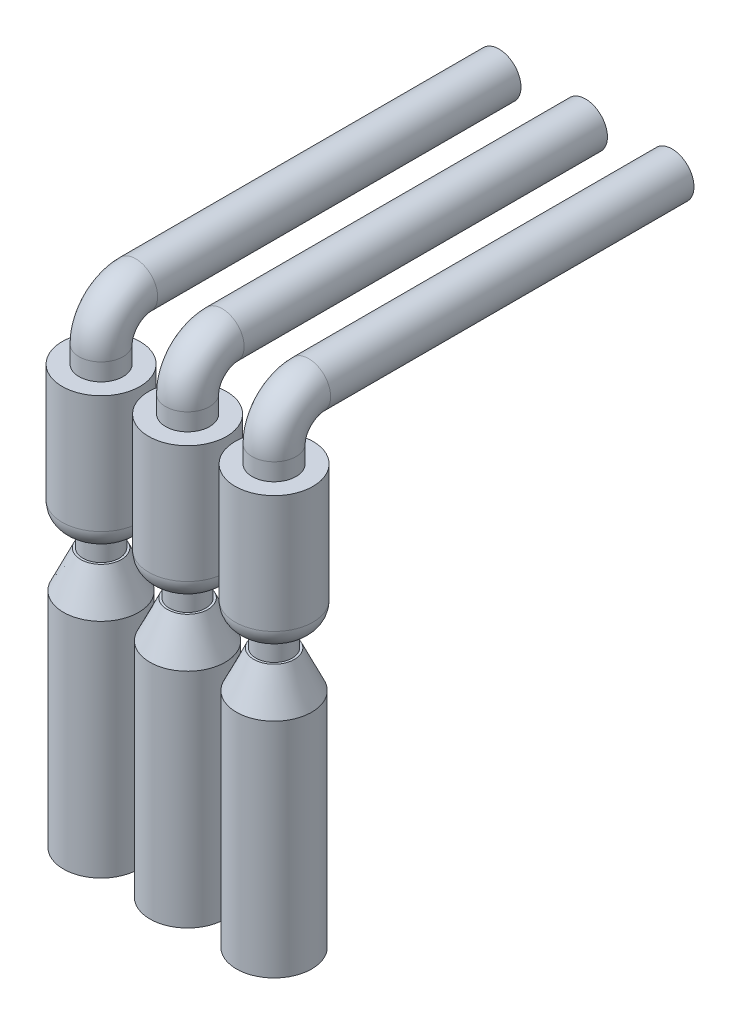
ISO-10303-21;
HEADER;
FILE_DESCRIPTION(('STEP AP214'),'2;1');
FILE_NAME('part.step','',(''),(''),'','','');
FILE_SCHEMA(('AUTOMOTIVE_DESIGN { 1 0 10303 214 1 1 1 1 }'));
ENDSEC;
DATA;
#1=APPLICATION_CONTEXT('core data for automotive mechanical design processes');
#2=APPLICATION_PROTOCOL_DEFINITION('international standard','automotive_design',2000,#1);
#3=PRODUCT_CONTEXT('',#1,'mechanical');
#4=PRODUCT('Part','Part','',(#3));
#5=PRODUCT_RELATED_PRODUCT_CATEGORY('part','',(#4));
#6=PRODUCT_DEFINITION_FORMATION('','',#4);
#7=PRODUCT_DEFINITION_CONTEXT('part definition',#1,'design');
#8=PRODUCT_DEFINITION('design','',#6,#7);
#9=PRODUCT_DEFINITION_SHAPE('','',#8);
#10=(LENGTH_UNIT() NAMED_UNIT(*) SI_UNIT(.MILLI.,.METRE.));
#11=(NAMED_UNIT(*) PLANE_ANGLE_UNIT() SI_UNIT($,.RADIAN.));
#12=(NAMED_UNIT(*) SI_UNIT($,.STERADIAN.) SOLID_ANGLE_UNIT());
#13=UNCERTAINTY_MEASURE_WITH_UNIT(LENGTH_MEASURE(1.E-05),#10,'distance_accuracy_value','');
#14=(GEOMETRIC_REPRESENTATION_CONTEXT(3) GLOBAL_UNCERTAINTY_ASSIGNED_CONTEXT((#13)) GLOBAL_UNIT_ASSIGNED_CONTEXT((#10,
#11,#12)) REPRESENTATION_CONTEXT('',''));
#15=CARTESIAN_POINT('',(0.,0.,0.));
#16=DIRECTION('',(0.,0.,1.));
#17=DIRECTION('',(1.,0.,0.));
#18=AXIS2_PLACEMENT_3D('',#15,#16,#17);
#19=CARTESIAN_POINT('',(1000.,0.,2000.));
#20=DIRECTION('',(0.,0.,-1.));
#21=DIRECTION('',(-1.,0.,0.));
#22=AXIS2_PLACEMENT_3D('',#19,#20,#21);
#23=CYLINDRICAL_SURFACE('',#22,127.);
#24=CARTESIAN_POINT('',(1000.,0.,0.));
#25=DIRECTION('',(0.,0.,1.));
#26=DIRECTION('',(1.,0.,0.));
#27=AXIS2_PLACEMENT_3D('',#24,#25,#26);
#28=CIRCLE('',#27,127.);
#29=CARTESIAN_POINT('',(1127.,0.,0.));
#30=VERTEX_POINT('',#29);
#31=EDGE_CURVE('E60',#30,#30,#28,.T.);
#32=ORIENTED_EDGE('',*,*,#31,.T.);
#33=EDGE_LOOP('',(#32));
#34=FACE_BOUND('',#33,.T.);
#35=CARTESIAN_POINT('',(1000.,0.,2100.));
#36=DIRECTION('',(0.,0.,1.));
#37=DIRECTION('',(1.,0.,0.));
#38=AXIS2_PLACEMENT_3D('',#35,#36,#37);
#39=CIRCLE('',#38,127.);
#40=CARTESIAN_POINT('',(1000.,127.,2100.));
#41=VERTEX_POINT('',#40);
#42=EDGE_CURVE('E69',#41,#41,#39,.T.);
#43=ORIENTED_EDGE('',*,*,#42,.F.);
#44=EDGE_LOOP('',(#43));
#45=FACE_BOUND('',#44,.T.);
#46=ADVANCED_FACE('F40',(#34,#45),#23,.T.);
#47=CARTESIAN_POINT('',(1000.,0.,0.));
#48=DIRECTION('',(0.,0.,1.));
#49=DIRECTION('',(1.,0.,0.));
#50=AXIS2_PLACEMENT_3D('',#47,#48,#49);
#51=PLANE('',#50);
#52=ORIENTED_EDGE('',*,*,#31,.F.);
#53=EDGE_LOOP('',(#52));
#54=FACE_BOUND('',#53,.T.);
#55=ADVANCED_FACE('F99',(#54),#51,.F.);
#56=CARTESIAN_POINT('',(1000.,-200.,2100.));
#57=DIRECTION('',(1.,0.,0.));
#58=DIRECTION('',(0.,0.,-1.));
#59=AXIS2_PLACEMENT_3D('',#56,#57,#58);
#60=TOROIDAL_SURFACE('',#59,200.,127.);
#61=CARTESIAN_POINT('',(1000.,-200.,2300.));
#62=DIRECTION('',(0.,-1.,0.));
#63=DIRECTION('',(1.,0.,0.));
#64=AXIS2_PLACEMENT_3D('',#61,#62,#63);
#65=CIRCLE('',#64,127.);
#66=CARTESIAN_POINT('',(1000.,-200.,2427.));
#67=VERTEX_POINT('',#66);
#68=EDGE_CURVE('E66',#67,#67,#65,.T.);
#69=CARTESIAN_POINT('',(1000.,-200.,2100.));
#70=DIRECTION('',(1.,0.,0.));
#71=DIRECTION('',(0.,0.,-1.));
#72=AXIS2_PLACEMENT_3D('',#69,#70,#71);
#73=CIRCLE('',#72,327.);
#74=EDGE_CURVE('',#41,#67,#73,.T.);
#75=ORIENTED_EDGE('',*,*,#42,.T.);
#76=ORIENTED_EDGE('',*,*,#68,.F.);
#77=ORIENTED_EDGE('',*,*,#74,.T.);
#78=ORIENTED_EDGE('',*,*,#74,.F.);
#79=EDGE_LOOP('',(#75,#77,#76,#78));
#80=FACE_BOUND('',#79,.T.);
#81=ADVANCED_FACE('F105',(#80),#60,.T.);
#82=CARTESIAN_POINT('',(1000.,-200.,2300.));
#83=DIRECTION('',(0.,-1.,0.));
#84=DIRECTION('',(0.,0.,-1.));
#85=AXIS2_PLACEMENT_3D('',#82,#83,#84);
#86=CYLINDRICAL_SURFACE('',#85,127.);
#87=CARTESIAN_POINT('',(1000.,-300.,2300.));
#88=DIRECTION('',(0.,-1.,0.));
#89=DIRECTION('',(1.,0.,0.));
#90=AXIS2_PLACEMENT_3D('',#87,#88,#89);
#91=CIRCLE('',#90,127.);
#92=CARTESIAN_POINT('',(1127.,-300.,2300.));
#93=VERTEX_POINT('',#92);
#94=EDGE_CURVE('E63',#93,#93,#91,.T.);
#95=ORIENTED_EDGE('',*,*,#94,.F.);
#96=EDGE_LOOP('',(#95));
#97=FACE_BOUND('',#96,.T.);
#98=ORIENTED_EDGE('',*,*,#68,.T.);
#99=EDGE_LOOP('',(#98));
#100=FACE_BOUND('',#99,.T.);
#101=ADVANCED_FACE('F108',(#97,#100),#86,.T.);
#102=CARTESIAN_POINT('',(1000.,-1100.,2300.));
#103=DIRECTION('',(0.,1.,0.));
#104=DIRECTION('',(-1.,0.,0.));
#105=AXIS2_PLACEMENT_3D('',#102,#103,#104);
#106=CYLINDRICAL_SURFACE('',#105,225.);
#107=CARTESIAN_POINT('',(1000.,-980.,2300.));
#108=DIRECTION('',(0.,-1.,0.));
#109=DIRECTION('',(1.,0.,0.));
#110=AXIS2_PLACEMENT_3D('',#107,#108,#109);
#111=CIRCLE('',#110,225.);
#112=CARTESIAN_POINT('',(1225.,-980.,2300.));
#113=VERTEX_POINT('',#112);
#114=EDGE_CURVE('E51',#113,#113,#111,.F.);
#115=ORIENTED_EDGE('',*,*,#114,.T.);
#116=EDGE_LOOP('',(#115));
#117=FACE_BOUND('',#116,.T.);
#118=CARTESIAN_POINT('',(1000.,-300.,2300.));
#119=DIRECTION('',(0.,-1.,0.));
#120=DIRECTION('',(1.,0.,0.));
#121=AXIS2_PLACEMENT_3D('',#118,#119,#120);
#122=CIRCLE('',#121,225.);
#123=CARTESIAN_POINT('',(1225.,-300.,2300.));
#124=VERTEX_POINT('',#123);
#125=EDGE_CURVE('E72',#124,#124,#122,.T.);
#126=ORIENTED_EDGE('',*,*,#125,.T.);
#127=EDGE_LOOP('',(#126));
#128=FACE_BOUND('',#127,.T.);
#129=ADVANCED_FACE('F117',(#117,#128),#106,.T.);
#130=CARTESIAN_POINT('',(1000.,-300.,2300.));
#131=DIRECTION('',(0.,-1.,0.));
#132=DIRECTION('',(1.,0.,0.));
#133=AXIS2_PLACEMENT_3D('',#130,#131,#132);
#134=PLANE('',#133);
#135=ORIENTED_EDGE('',*,*,#94,.T.);
#136=EDGE_LOOP('',(#135));
#137=FACE_BOUND('',#136,.T.);
#138=ORIENTED_EDGE('',*,*,#125,.F.);
#139=EDGE_LOOP('',(#138));
#140=FACE_BOUND('',#139,.T.);
#141=ADVANCED_FACE('F112',(#137,#140),#134,.F.);
#142=CARTESIAN_POINT('',(1000.,-980.,2300.));
#143=DIRECTION('',(0.,-1.,0.));
#144=DIRECTION('',(1.,0.,0.));
#145=AXIS2_PLACEMENT_3D('',#142,#143,#144);
#146=DEGENERATE_TOROIDAL_SURFACE('',#145,105.,120.,.T.);
#147=ORIENTED_EDGE('',*,*,#114,.F.);
#148=EDGE_LOOP('',(#147));
#149=FACE_BOUND('',#148,.T.);
#150=CARTESIAN_POINT('',(1000.,-1100.,2300.));
#151=DIRECTION('',(0.,-1.,0.));
#152=DIRECTION('',(1.,0.,0.));
#153=AXIS2_PLACEMENT_3D('',#150,#151,#152);
#154=CIRCLE('',#153,105.);
#155=CARTESIAN_POINT('',(1105.,-1100.,2300.));
#156=VERTEX_POINT('',#155);
#157=EDGE_CURVE('E55',#156,#156,#154,.T.);
#158=ORIENTED_EDGE('',*,*,#157,.F.);
#159=EDGE_LOOP('',(#158));
#160=FACE_BOUND('',#159,.T.);
#161=ADVANCED_FACE('F94',(#149,#160),#146,.T.);
#162=CARTESIAN_POINT('',(1000.,-1220.,2300.));
#163=DIRECTION('',(0.,1.,0.));
#164=DIRECTION('',(-1.,0.,0.));
#165=AXIS2_PLACEMENT_3D('',#162,#163,#164);
#166=CYLINDRICAL_SURFACE('',#165,105.);
#167=CARTESIAN_POINT('',(1000.,-1220.,2300.));
#168=DIRECTION('',(0.,-1.,0.));
#169=DIRECTION('',(1.,0.,0.));
#170=AXIS2_PLACEMENT_3D('',#167,#168,#169);
#171=CIRCLE('',#170,105.);
#172=CARTESIAN_POINT('',(1105.,-1220.,2300.));
#173=VERTEX_POINT('',#172);
#174=EDGE_CURVE('E75',#173,#173,#171,.T.);
#175=ORIENTED_EDGE('',*,*,#174,.F.);
#176=EDGE_LOOP('',(#175));
#177=FACE_BOUND('',#176,.T.);
#178=ORIENTED_EDGE('',*,*,#157,.T.);
#179=EDGE_LOOP('',(#178));
#180=FACE_BOUND('',#179,.T.);
#181=ADVANCED_FACE('F86',(#177,#180),#166,.T.);
#182=CARTESIAN_POINT('',(1000.,-2720.,2300.));
#183=DIRECTION('',(0.,1.,0.));
#184=DIRECTION('',(-1.,0.,0.));
#185=AXIS2_PLACEMENT_3D('',#182,#183,#184);
#186=CYLINDRICAL_SURFACE('',#185,217.5);
#187=CARTESIAN_POINT('',(1000.,-1434.45069205095,2300.));
#188=DIRECTION('',(0.,-1.,0.));
#189=DIRECTION('',(0.,0.,-1.));
#190=AXIS2_PLACEMENT_3D('',#187,#188,#189);
#191=CIRCLE('',#190,217.5);
#192=CARTESIAN_POINT('',(1000.,-1434.45069205095,2082.5));
#193=VERTEX_POINT('',#192);
#194=EDGE_CURVE('E47',#193,#193,#191,.T.);
#195=ORIENTED_EDGE('',*,*,#194,.T.);
#196=EDGE_LOOP('',(#195));
#197=FACE_BOUND('',#196,.T.);
#198=CARTESIAN_POINT('',(1000.,-2720.,2300.));
#199=DIRECTION('',(0.,-1.,0.));
#200=DIRECTION('',(1.,0.,0.));
#201=AXIS2_PLACEMENT_3D('',#198,#199,#200);
#202=CIRCLE('',#201,217.5);
#203=CARTESIAN_POINT('',(1217.5,-2720.,2300.));
#204=VERTEX_POINT('',#203);
#205=EDGE_CURVE('E78',#204,#204,#202,.T.);
#206=ORIENTED_EDGE('',*,*,#205,.F.);
#207=EDGE_LOOP('',(#206));
#208=FACE_BOUND('',#207,.T.);
#209=ADVANCED_FACE('F84',(#197,#208),#186,.T.);
#210=CARTESIAN_POINT('',(1000.,-2720.,2300.));
#211=DIRECTION('',(0.,-1.,0.));
#212=DIRECTION('',(1.,0.,0.));
#213=AXIS2_PLACEMENT_3D('',#210,#211,#212);
#214=PLANE('',#213);
#215=ORIENTED_EDGE('',*,*,#205,.T.);
#216=EDGE_LOOP('',(#215));
#217=FACE_BOUND('',#216,.T.);
#218=ADVANCED_FACE('F82',(#217),#214,.T.);
#219=CARTESIAN_POINT('',(1000.,-1220.,2300.));
#220=DIRECTION('',(0.,-1.,0.));
#221=DIRECTION('',(1.,0.,0.));
#222=AXIS2_PLACEMENT_3D('',#219,#220,#221);
#223=PLANE('',#222);
#224=CARTESIAN_POINT('',(1000.,-1220.,2300.));
#225=DIRECTION('',(0.,-1.,0.));
#226=DIRECTION('',(1.,0.,0.));
#227=AXIS2_PLACEMENT_3D('',#224,#225,#226);
#228=CIRCLE('',#227,117.500000000001);
#229=CARTESIAN_POINT('',(1117.5,-1220.,2300.));
#230=VERTEX_POINT('',#229);
#231=EDGE_CURVE('E11',#230,#230,#228,.F.);
#232=ORIENTED_EDGE('',*,*,#231,.T.);
#233=EDGE_LOOP('',(#232));
#234=FACE_BOUND('',#233,.T.);
#235=ORIENTED_EDGE('',*,*,#174,.T.);
#236=EDGE_LOOP('',(#235));
#237=FACE_BOUND('',#236,.T.);
#238=ADVANCED_FACE('F92',(#234,#237),#223,.F.);
#239=CARTESIAN_POINT('',(1000.,-1434.45069205095,2300.));
#240=DIRECTION('',(0.,-1.,0.));
#241=DIRECTION('',(0.,0.,-1.));
#242=AXIS2_PLACEMENT_3D('',#239,#240,#241);
#243=CONICAL_SURFACE('',#242,217.5,0.436332312998585);
#244=ORIENTED_EDGE('',*,*,#231,.F.);
#245=EDGE_LOOP('',(#244));
#246=FACE_BOUND('',#245,.T.);
#247=ORIENTED_EDGE('',*,*,#194,.F.);
#248=EDGE_LOOP('',(#247));
#249=FACE_BOUND('',#248,.T.);
#250=ADVANCED_FACE('F42',(#246,#249),#243,.T.);
#251=CLOSED_SHELL('',(#46,#55,#81,#101,#129,#141,#161,#181,#209,#218,#238,#250));
#252=MANIFOLD_SOLID_BREP('B2',#251);
#253=CARTESIAN_POINT('',(500.,0.,2000.));
#254=DIRECTION('',(0.,0.,-1.));
#255=DIRECTION('',(-1.,0.,0.));
#256=AXIS2_PLACEMENT_3D('',#253,#254,#255);
#257=CYLINDRICAL_SURFACE('',#256,127.);
#258=CARTESIAN_POINT('',(500.,0.,0.));
#259=DIRECTION('',(0.,0.,1.));
#260=DIRECTION('',(1.,0.,0.));
#261=AXIS2_PLACEMENT_3D('',#258,#259,#260);
#262=CIRCLE('',#261,127.);
#263=CARTESIAN_POINT('',(627.,0.,0.));
#264=VERTEX_POINT('',#263);
#265=EDGE_CURVE('E246',#264,#264,#262,.T.);
#266=ORIENTED_EDGE('',*,*,#265,.T.);
#267=EDGE_LOOP('',(#266));
#268=FACE_BOUND('',#267,.T.);
#269=CARTESIAN_POINT('',(500.,0.,2100.));
#270=DIRECTION('',(0.,0.,1.));
#271=DIRECTION('',(1.,0.,0.));
#272=AXIS2_PLACEMENT_3D('',#269,#270,#271);
#273=CIRCLE('',#272,127.);
#274=CARTESIAN_POINT('',(500.,127.,2100.));
#275=VERTEX_POINT('',#274);
#276=EDGE_CURVE('E255',#275,#275,#273,.T.);
#277=ORIENTED_EDGE('',*,*,#276,.F.);
#278=EDGE_LOOP('',(#277));
#279=FACE_BOUND('',#278,.T.);
#280=ADVANCED_FACE('F226',(#268,#279),#257,.T.);
#281=CARTESIAN_POINT('',(500.,0.,0.));
#282=DIRECTION('',(0.,0.,1.));
#283=DIRECTION('',(1.,0.,0.));
#284=AXIS2_PLACEMENT_3D('',#281,#282,#283);
#285=PLANE('',#284);
#286=ORIENTED_EDGE('',*,*,#265,.F.);
#287=EDGE_LOOP('',(#286));
#288=FACE_BOUND('',#287,.T.);
#289=ADVANCED_FACE('F285',(#288),#285,.F.);
#290=CARTESIAN_POINT('',(500.,-200.,2100.));
#291=DIRECTION('',(1.,0.,0.));
#292=DIRECTION('',(0.,0.,-1.));
#293=AXIS2_PLACEMENT_3D('',#290,#291,#292);
#294=TOROIDAL_SURFACE('',#293,200.,127.);
#295=CARTESIAN_POINT('',(500.,-200.,2300.));
#296=DIRECTION('',(0.,-1.,0.));
#297=DIRECTION('',(1.,0.,0.));
#298=AXIS2_PLACEMENT_3D('',#295,#296,#297);
#299=CIRCLE('',#298,127.);
#300=CARTESIAN_POINT('',(500.,-200.,2427.));
#301=VERTEX_POINT('',#300);
#302=EDGE_CURVE('E252',#301,#301,#299,.T.);
#303=CARTESIAN_POINT('',(500.,-200.,2100.));
#304=DIRECTION('',(1.,0.,0.));
#305=DIRECTION('',(0.,0.,-1.));
#306=AXIS2_PLACEMENT_3D('',#303,#304,#305);
#307=CIRCLE('',#306,327.);
#308=EDGE_CURVE('',#275,#301,#307,.T.);
#309=ORIENTED_EDGE('',*,*,#276,.T.);
#310=ORIENTED_EDGE('',*,*,#302,.F.);
#311=ORIENTED_EDGE('',*,*,#308,.T.);
#312=ORIENTED_EDGE('',*,*,#308,.F.);
#313=EDGE_LOOP('',(#309,#311,#310,#312));
#314=FACE_BOUND('',#313,.T.);
#315=ADVANCED_FACE('F291',(#314),#294,.T.);
#316=CARTESIAN_POINT('',(500.,-200.,2300.));
#317=DIRECTION('',(0.,-1.,0.));
#318=DIRECTION('',(0.,0.,-1.));
#319=AXIS2_PLACEMENT_3D('',#316,#317,#318);
#320=CYLINDRICAL_SURFACE('',#319,127.);
#321=CARTESIAN_POINT('',(500.,-300.,2300.));
#322=DIRECTION('',(0.,-1.,0.));
#323=DIRECTION('',(1.,0.,0.));
#324=AXIS2_PLACEMENT_3D('',#321,#322,#323);
#325=CIRCLE('',#324,127.);
#326=CARTESIAN_POINT('',(627.,-300.,2300.));
#327=VERTEX_POINT('',#326);
#328=EDGE_CURVE('E249',#327,#327,#325,.T.);
#329=ORIENTED_EDGE('',*,*,#328,.F.);
#330=EDGE_LOOP('',(#329));
#331=FACE_BOUND('',#330,.T.);
#332=ORIENTED_EDGE('',*,*,#302,.T.);
#333=EDGE_LOOP('',(#332));
#334=FACE_BOUND('',#333,.T.);
#335=ADVANCED_FACE('F294',(#331,#334),#320,.T.);
#336=CARTESIAN_POINT('',(500.,-1100.,2300.));
#337=DIRECTION('',(0.,1.,0.));
#338=DIRECTION('',(-1.,0.,0.));
#339=AXIS2_PLACEMENT_3D('',#336,#337,#338);
#340=CYLINDRICAL_SURFACE('',#339,225.);
#341=CARTESIAN_POINT('',(500.,-980.,2300.));
#342=DIRECTION('',(0.,-1.,0.));
#343=DIRECTION('',(1.,0.,0.));
#344=AXIS2_PLACEMENT_3D('',#341,#342,#343);
#345=CIRCLE('',#344,225.);
#346=CARTESIAN_POINT('',(725.,-980.,2300.));
#347=VERTEX_POINT('',#346);
#348=EDGE_CURVE('E237',#347,#347,#345,.F.);
#349=ORIENTED_EDGE('',*,*,#348,.T.);
#350=EDGE_LOOP('',(#349));
#351=FACE_BOUND('',#350,.T.);
#352=CARTESIAN_POINT('',(500.,-300.,2300.));
#353=DIRECTION('',(0.,-1.,0.));
#354=DIRECTION('',(1.,0.,0.));
#355=AXIS2_PLACEMENT_3D('',#352,#353,#354);
#356=CIRCLE('',#355,225.);
#357=CARTESIAN_POINT('',(725.,-300.,2300.));
#358=VERTEX_POINT('',#357);
#359=EDGE_CURVE('E258',#358,#358,#356,.T.);
#360=ORIENTED_EDGE('',*,*,#359,.T.);
#361=EDGE_LOOP('',(#360));
#362=FACE_BOUND('',#361,.T.);
#363=ADVANCED_FACE('F303',(#351,#362),#340,.T.);
#364=CARTESIAN_POINT('',(500.,-300.,2300.));
#365=DIRECTION('',(0.,-1.,0.));
#366=DIRECTION('',(1.,0.,0.));
#367=AXIS2_PLACEMENT_3D('',#364,#365,#366);
#368=PLANE('',#367);
#369=ORIENTED_EDGE('',*,*,#328,.T.);
#370=EDGE_LOOP('',(#369));
#371=FACE_BOUND('',#370,.T.);
#372=ORIENTED_EDGE('',*,*,#359,.F.);
#373=EDGE_LOOP('',(#372));
#374=FACE_BOUND('',#373,.T.);
#375=ADVANCED_FACE('F298',(#371,#374),#368,.F.);
#376=CARTESIAN_POINT('',(500.,-980.,2300.));
#377=DIRECTION('',(0.,-1.,0.));
#378=DIRECTION('',(1.,0.,0.));
#379=AXIS2_PLACEMENT_3D('',#376,#377,#378);
#380=DEGENERATE_TOROIDAL_SURFACE('',#379,105.,120.,.T.);
#381=ORIENTED_EDGE('',*,*,#348,.F.);
#382=EDGE_LOOP('',(#381));
#383=FACE_BOUND('',#382,.T.);
#384=CARTESIAN_POINT('',(500.,-1100.,2300.));
#385=DIRECTION('',(0.,-1.,0.));
#386=DIRECTION('',(1.,0.,0.));
#387=AXIS2_PLACEMENT_3D('',#384,#385,#386);
#388=CIRCLE('',#387,105.);
#389=CARTESIAN_POINT('',(605.,-1100.,2300.));
#390=VERTEX_POINT('',#389);
#391=EDGE_CURVE('E241',#390,#390,#388,.T.);
#392=ORIENTED_EDGE('',*,*,#391,.F.);
#393=EDGE_LOOP('',(#392));
#394=FACE_BOUND('',#393,.T.);
#395=ADVANCED_FACE('F280',(#383,#394),#380,.T.);
#396=CARTESIAN_POINT('',(500.,-1220.,2300.));
#397=DIRECTION('',(0.,1.,0.));
#398=DIRECTION('',(-1.,0.,0.));
#399=AXIS2_PLACEMENT_3D('',#396,#397,#398);
#400=CYLINDRICAL_SURFACE('',#399,105.);
#401=CARTESIAN_POINT('',(500.,-1220.,2300.));
#402=DIRECTION('',(0.,-1.,0.));
#403=DIRECTION('',(1.,0.,0.));
#404=AXIS2_PLACEMENT_3D('',#401,#402,#403);
#405=CIRCLE('',#404,105.);
#406=CARTESIAN_POINT('',(605.,-1220.,2300.));
#407=VERTEX_POINT('',#406);
#408=EDGE_CURVE('E261',#407,#407,#405,.T.);
#409=ORIENTED_EDGE('',*,*,#408,.F.);
#410=EDGE_LOOP('',(#409));
#411=FACE_BOUND('',#410,.T.);
#412=ORIENTED_EDGE('',*,*,#391,.T.);
#413=EDGE_LOOP('',(#412));
#414=FACE_BOUND('',#413,.T.);
#415=ADVANCED_FACE('F272',(#411,#414),#400,.T.);
#416=CARTESIAN_POINT('',(500.,-2720.,2300.));
#417=DIRECTION('',(0.,1.,0.));
#418=DIRECTION('',(-1.,0.,0.));
#419=AXIS2_PLACEMENT_3D('',#416,#417,#418);
#420=CYLINDRICAL_SURFACE('',#419,217.5);
#421=CARTESIAN_POINT('',(500.,-1434.45069205095,2300.));
#422=DIRECTION('',(0.,-1.,0.));
#423=DIRECTION('',(0.,0.,-1.));
#424=AXIS2_PLACEMENT_3D('',#421,#422,#423);
#425=CIRCLE('',#424,217.5);
#426=CARTESIAN_POINT('',(500.,-1434.45069205095,2082.5));
#427=VERTEX_POINT('',#426);
#428=EDGE_CURVE('E233',#427,#427,#425,.T.);
#429=ORIENTED_EDGE('',*,*,#428,.T.);
#430=EDGE_LOOP('',(#429));
#431=FACE_BOUND('',#430,.T.);
#432=CARTESIAN_POINT('',(500.,-2720.,2300.));
#433=DIRECTION('',(0.,-1.,0.));
#434=DIRECTION('',(1.,0.,0.));
#435=AXIS2_PLACEMENT_3D('',#432,#433,#434);
#436=CIRCLE('',#435,217.5);
#437=CARTESIAN_POINT('',(717.5,-2720.,2300.));
#438=VERTEX_POINT('',#437);
#439=EDGE_CURVE('E264',#438,#438,#436,.T.);
#440=ORIENTED_EDGE('',*,*,#439,.F.);
#441=EDGE_LOOP('',(#440));
#442=FACE_BOUND('',#441,.T.);
#443=ADVANCED_FACE('F270',(#431,#442),#420,.T.);
#444=CARTESIAN_POINT('',(500.,-2720.,2300.));
#445=DIRECTION('',(0.,-1.,0.));
#446=DIRECTION('',(1.,0.,0.));
#447=AXIS2_PLACEMENT_3D('',#444,#445,#446);
#448=PLANE('',#447);
#449=ORIENTED_EDGE('',*,*,#439,.T.);
#450=EDGE_LOOP('',(#449));
#451=FACE_BOUND('',#450,.T.);
#452=ADVANCED_FACE('F268',(#451),#448,.T.);
#453=CARTESIAN_POINT('',(500.,-1220.,2300.));
#454=DIRECTION('',(0.,-1.,0.));
#455=DIRECTION('',(1.,0.,0.));
#456=AXIS2_PLACEMENT_3D('',#453,#454,#455);
#457=PLANE('',#456);
#458=CARTESIAN_POINT('',(500.,-1220.,2300.));
#459=DIRECTION('',(0.,-1.,0.));
#460=DIRECTION('',(1.,0.,0.));
#461=AXIS2_PLACEMENT_3D('',#458,#459,#460);
#462=CIRCLE('',#461,117.500000000001);
#463=CARTESIAN_POINT('',(617.500000000001,-1220.,2300.));
#464=VERTEX_POINT('',#463);
#465=EDGE_CURVE('E39',#464,#464,#462,.F.);
#466=ORIENTED_EDGE('',*,*,#465,.T.);
#467=EDGE_LOOP('',(#466));
#468=FACE_BOUND('',#467,.T.);
#469=ORIENTED_EDGE('',*,*,#408,.T.);
#470=EDGE_LOOP('',(#469));
#471=FACE_BOUND('',#470,.T.);
#472=ADVANCED_FACE('F278',(#468,#471),#457,.F.);
#473=CARTESIAN_POINT('',(500.,-1434.45069205095,2300.));
#474=DIRECTION('',(0.,-1.,0.));
#475=DIRECTION('',(0.,0.,-1.));
#476=AXIS2_PLACEMENT_3D('',#473,#474,#475);
#477=CONICAL_SURFACE('',#476,217.5,0.436332312998585);
#478=ORIENTED_EDGE('',*,*,#465,.F.);
#479=EDGE_LOOP('',(#478));
#480=FACE_BOUND('',#479,.T.);
#481=ORIENTED_EDGE('',*,*,#428,.F.);
#482=EDGE_LOOP('',(#481));
#483=FACE_BOUND('',#482,.T.);
#484=ADVANCED_FACE('F228',(#480,#483),#477,.T.);
#485=CLOSED_SHELL('',(#280,#289,#315,#335,#363,#375,#395,#415,#443,#452,#472,#484));
#486=MANIFOLD_SOLID_BREP('B6',#485);
#487=CARTESIAN_POINT('',(0.,0.,2000.));
#488=DIRECTION('',(0.,0.,-1.));
#489=DIRECTION('',(-1.,0.,0.));
#490=AXIS2_PLACEMENT_3D('',#487,#488,#489);
#491=CYLINDRICAL_SURFACE('',#490,127.);
#492=CARTESIAN_POINT('',(0.,0.,0.));
#493=DIRECTION('',(0.,0.,1.));
#494=DIRECTION('',(1.,0.,0.));
#495=AXIS2_PLACEMENT_3D('',#492,#493,#494);
#496=CIRCLE('',#495,127.);
#497=CARTESIAN_POINT('',(127.,0.,0.));
#498=VERTEX_POINT('',#497);
#499=EDGE_CURVE('E425',#498,#498,#496,.T.);
#500=ORIENTED_EDGE('',*,*,#499,.T.);
#501=EDGE_LOOP('',(#500));
#502=FACE_BOUND('',#501,.T.);
#503=CARTESIAN_POINT('',(0.,0.,2100.));
#504=DIRECTION('',(0.,0.,1.));
#505=DIRECTION('',(1.,0.,0.));
#506=AXIS2_PLACEMENT_3D('',#503,#504,#505);
#507=CIRCLE('',#506,127.);
#508=CARTESIAN_POINT('',(0.,127.,2100.));
#509=VERTEX_POINT('',#508);
#510=EDGE_CURVE('E434',#509,#509,#507,.T.);
#511=ORIENTED_EDGE('',*,*,#510,.F.);
#512=EDGE_LOOP('',(#511));
#513=FACE_BOUND('',#512,.T.);
#514=ADVANCED_FACE('F405',(#502,#513),#491,.T.);
#515=CARTESIAN_POINT('',(0.,0.,0.));
#516=DIRECTION('',(0.,0.,1.));
#517=DIRECTION('',(1.,0.,0.));
#518=AXIS2_PLACEMENT_3D('',#515,#516,#517);
#519=PLANE('',#518);
#520=ORIENTED_EDGE('',*,*,#499,.F.);
#521=EDGE_LOOP('',(#520));
#522=FACE_BOUND('',#521,.T.);
#523=ADVANCED_FACE('F464',(#522),#519,.F.);
#524=CARTESIAN_POINT('',(0.,-200.,2100.));
#525=DIRECTION('',(1.,0.,0.));
#526=DIRECTION('',(0.,0.,-1.));
#527=AXIS2_PLACEMENT_3D('',#524,#525,#526);
#528=TOROIDAL_SURFACE('',#527,200.,127.);
#529=CARTESIAN_POINT('',(0.,-200.,2300.));
#530=DIRECTION('',(0.,-1.,0.));
#531=DIRECTION('',(1.,0.,0.));
#532=AXIS2_PLACEMENT_3D('',#529,#530,#531);
#533=CIRCLE('',#532,127.);
#534=CARTESIAN_POINT('',(0.,-200.,2427.));
#535=VERTEX_POINT('',#534);
#536=EDGE_CURVE('E431',#535,#535,#533,.T.);
#537=CARTESIAN_POINT('',(0.,-200.,2100.));
#538=DIRECTION('',(1.,0.,0.));
#539=DIRECTION('',(0.,0.,-1.));
#540=AXIS2_PLACEMENT_3D('',#537,#538,#539);
#541=CIRCLE('',#540,327.);
#542=EDGE_CURVE('',#509,#535,#541,.T.);
#543=ORIENTED_EDGE('',*,*,#510,.T.);
#544=ORIENTED_EDGE('',*,*,#536,.F.);
#545=ORIENTED_EDGE('',*,*,#542,.T.);
#546=ORIENTED_EDGE('',*,*,#542,.F.);
#547=EDGE_LOOP('',(#543,#545,#544,#546));
#548=FACE_BOUND('',#547,.T.);
#549=ADVANCED_FACE('F470',(#548),#528,.T.);
#550=CARTESIAN_POINT('',(0.,-200.,2300.));
#551=DIRECTION('',(0.,-1.,0.));
#552=DIRECTION('',(1.,0.,0.));
#553=AXIS2_PLACEMENT_3D('',#550,#551,#552);
#554=CYLINDRICAL_SURFACE('',#553,127.);
#555=CARTESIAN_POINT('',(0.,-300.,2300.));
#556=DIRECTION('',(0.,-1.,0.));
#557=DIRECTION('',(1.,0.,0.));
#558=AXIS2_PLACEMENT_3D('',#555,#556,#557);
#559=CIRCLE('',#558,127.);
#560=CARTESIAN_POINT('',(127.,-300.,2300.));
#561=VERTEX_POINT('',#560);
#562=EDGE_CURVE('E428',#561,#561,#559,.T.);
#563=ORIENTED_EDGE('',*,*,#562,.F.);
#564=EDGE_LOOP('',(#563));
#565=FACE_BOUND('',#564,.T.);
#566=ORIENTED_EDGE('',*,*,#536,.T.);
#567=EDGE_LOOP('',(#566));
#568=FACE_BOUND('',#567,.T.);
#569=ADVANCED_FACE('F473',(#565,#568),#554,.T.);
#570=CARTESIAN_POINT('',(0.,-1100.,2300.));
#571=DIRECTION('',(0.,1.,0.));
#572=DIRECTION('',(-1.,0.,0.));
#573=AXIS2_PLACEMENT_3D('',#570,#571,#572);
#574=CYLINDRICAL_SURFACE('',#573,225.);
#575=CARTESIAN_POINT('',(0.,-980.,2300.));
#576=DIRECTION('',(0.,-1.,0.));
#577=DIRECTION('',(1.,0.,0.));
#578=AXIS2_PLACEMENT_3D('',#575,#576,#577);
#579=CIRCLE('',#578,225.);
#580=CARTESIAN_POINT('',(225.,-980.,2300.));
#581=VERTEX_POINT('',#580);
#582=EDGE_CURVE('E416',#581,#581,#579,.F.);
#583=ORIENTED_EDGE('',*,*,#582,.T.);
#584=EDGE_LOOP('',(#583));
#585=FACE_BOUND('',#584,.T.);
#586=CARTESIAN_POINT('',(0.,-300.,2300.));
#587=DIRECTION('',(0.,-1.,0.));
#588=DIRECTION('',(1.,0.,0.));
#589=AXIS2_PLACEMENT_3D('',#586,#587,#588);
#590=CIRCLE('',#589,225.);
#591=CARTESIAN_POINT('',(225.,-300.,2300.));
#592=VERTEX_POINT('',#591);
#593=EDGE_CURVE('E437',#592,#592,#590,.T.);
#594=ORIENTED_EDGE('',*,*,#593,.T.);
#595=EDGE_LOOP('',(#594));
#596=FACE_BOUND('',#595,.T.);
#597=ADVANCED_FACE('F482',(#585,#596),#574,.T.);
#598=CARTESIAN_POINT('',(0.,-300.,2300.));
#599=DIRECTION('',(0.,-1.,0.));
#600=DIRECTION('',(1.,0.,0.));
#601=AXIS2_PLACEMENT_3D('',#598,#599,#600);
#602=PLANE('',#601);
#603=ORIENTED_EDGE('',*,*,#562,.T.);
#604=EDGE_LOOP('',(#603));
#605=FACE_BOUND('',#604,.T.);
#606=ORIENTED_EDGE('',*,*,#593,.F.);
#607=EDGE_LOOP('',(#606));
#608=FACE_BOUND('',#607,.T.);
#609=ADVANCED_FACE('F477',(#605,#608),#602,.F.);
#610=CARTESIAN_POINT('',(0.,-980.,2300.));
#611=DIRECTION('',(0.,-1.,0.));
#612=DIRECTION('',(1.,0.,0.));
#613=AXIS2_PLACEMENT_3D('',#610,#611,#612);
#614=DEGENERATE_TOROIDAL_SURFACE('',#613,105.,120.,.T.);
#615=ORIENTED_EDGE('',*,*,#582,.F.);
#616=EDGE_LOOP('',(#615));
#617=FACE_BOUND('',#616,.T.);
#618=CARTESIAN_POINT('',(0.,-1100.,2300.));
#619=DIRECTION('',(0.,-1.,0.));
#620=DIRECTION('',(1.,0.,0.));
#621=AXIS2_PLACEMENT_3D('',#618,#619,#620);
#622=CIRCLE('',#621,105.);
#623=CARTESIAN_POINT('',(105.,-1100.,2300.));
#624=VERTEX_POINT('',#623);
#625=EDGE_CURVE('E420',#624,#624,#622,.T.);
#626=ORIENTED_EDGE('',*,*,#625,.F.);
#627=EDGE_LOOP('',(#626));
#628=FACE_BOUND('',#627,.T.);
#629=ADVANCED_FACE('F459',(#617,#628),#614,.T.);
#630=CARTESIAN_POINT('',(0.,-1220.,2300.));
#631=DIRECTION('',(0.,1.,0.));
#632=DIRECTION('',(-1.,0.,0.));
#633=AXIS2_PLACEMENT_3D('',#630,#631,#632);
#634=CYLINDRICAL_SURFACE('',#633,105.);
#635=CARTESIAN_POINT('',(0.,-1220.,2300.));
#636=DIRECTION('',(0.,-1.,0.));
#637=DIRECTION('',(1.,0.,0.));
#638=AXIS2_PLACEMENT_3D('',#635,#636,#637);
#639=CIRCLE('',#638,105.);
#640=CARTESIAN_POINT('',(105.,-1220.,2300.));
#641=VERTEX_POINT('',#640);
#642=EDGE_CURVE('E440',#641,#641,#639,.T.);
#643=ORIENTED_EDGE('',*,*,#642,.F.);
#644=EDGE_LOOP('',(#643));
#645=FACE_BOUND('',#644,.T.);
#646=ORIENTED_EDGE('',*,*,#625,.T.);
#647=EDGE_LOOP('',(#646));
#648=FACE_BOUND('',#647,.T.);
#649=ADVANCED_FACE('F451',(#645,#648),#634,.T.);
#650=CARTESIAN_POINT('',(0.,-2720.,2300.));
#651=DIRECTION('',(0.,1.,0.));
#652=DIRECTION('',(-1.,0.,0.));
#653=AXIS2_PLACEMENT_3D('',#650,#651,#652);
#654=CYLINDRICAL_SURFACE('',#653,217.5);
#655=CARTESIAN_POINT('',(0.,-1434.45069205095,2300.));
#656=DIRECTION('',(0.,-1.,0.));
#657=DIRECTION('',(1.,0.,0.));
#658=AXIS2_PLACEMENT_3D('',#655,#656,#657);
#659=CIRCLE('',#658,217.5);
#660=CARTESIAN_POINT('',(217.5,-1434.45069205095,2300.));
#661=VERTEX_POINT('',#660);
#662=EDGE_CURVE('E412',#661,#661,#659,.T.);
#663=ORIENTED_EDGE('',*,*,#662,.T.);
#664=EDGE_LOOP('',(#663));
#665=FACE_BOUND('',#664,.T.);
#666=CARTESIAN_POINT('',(0.,-2720.,2300.));
#667=DIRECTION('',(0.,-1.,0.));
#668=DIRECTION('',(1.,0.,0.));
#669=AXIS2_PLACEMENT_3D('',#666,#667,#668);
#670=CIRCLE('',#669,217.5);
#671=CARTESIAN_POINT('',(217.5,-2720.,2300.));
#672=VERTEX_POINT('',#671);
#673=EDGE_CURVE('E443',#672,#672,#670,.T.);
#674=ORIENTED_EDGE('',*,*,#673,.F.);
#675=EDGE_LOOP('',(#674));
#676=FACE_BOUND('',#675,.T.);
#677=ADVANCED_FACE('F449',(#665,#676),#654,.T.);
#678=CARTESIAN_POINT('',(0.,-2720.,2300.));
#679=DIRECTION('',(0.,-1.,0.));
#680=DIRECTION('',(1.,0.,0.));
#681=AXIS2_PLACEMENT_3D('',#678,#679,#680);
#682=PLANE('',#681);
#683=ORIENTED_EDGE('',*,*,#673,.T.);
#684=EDGE_LOOP('',(#683));
#685=FACE_BOUND('',#684,.T.);
#686=ADVANCED_FACE('F447',(#685),#682,.T.);
#687=CARTESIAN_POINT('',(0.,-1220.,2300.));
#688=DIRECTION('',(0.,-1.,0.));
#689=DIRECTION('',(1.,0.,0.));
#690=AXIS2_PLACEMENT_3D('',#687,#688,#689);
#691=PLANE('',#690);
#692=CARTESIAN_POINT('',(0.,-1220.,2300.));
#693=DIRECTION('',(0.,-1.,0.));
#694=DIRECTION('',(1.,0.,0.));
#695=AXIS2_PLACEMENT_3D('',#692,#693,#694);
#696=CIRCLE('',#695,117.500000000001);
#697=CARTESIAN_POINT('',(117.500000000001,-1220.,2300.));
#698=VERTEX_POINT('',#697);
#699=EDGE_CURVE('E225',#698,#698,#696,.F.);
#700=ORIENTED_EDGE('',*,*,#699,.T.);
#701=EDGE_LOOP('',(#700));
#702=FACE_BOUND('',#701,.T.);
#703=ORIENTED_EDGE('',*,*,#642,.T.);
#704=EDGE_LOOP('',(#703));
#705=FACE_BOUND('',#704,.T.);
#706=ADVANCED_FACE('F457',(#702,#705),#691,.F.);
#707=CARTESIAN_POINT('',(0.,-1434.45069205095,2300.));
#708=DIRECTION('',(0.,-1.,0.));
#709=DIRECTION('',(1.,0.,0.));
#710=AXIS2_PLACEMENT_3D('',#707,#708,#709);
#711=CONICAL_SURFACE('',#710,217.5,0.436332312998585);
#712=ORIENTED_EDGE('',*,*,#699,.F.);
#713=EDGE_LOOP('',(#712));
#714=FACE_BOUND('',#713,.T.);
#715=ORIENTED_EDGE('',*,*,#662,.F.);
#716=EDGE_LOOP('',(#715));
#717=FACE_BOUND('',#716,.T.);
#718=ADVANCED_FACE('F407',(#714,#717),#711,.T.);
#719=CLOSED_SHELL('',(#514,#523,#549,#569,#597,#609,#629,#649,#677,#686,#706,#718));
#720=MANIFOLD_SOLID_BREP('B34',#719);
#721=ADVANCED_BREP_SHAPE_REPRESENTATION('',(#18,#252,#486,#720),#14);
#722=SHAPE_DEFINITION_REPRESENTATION(#9,#721);
ENDSEC;
END-ISO-10303-21;
